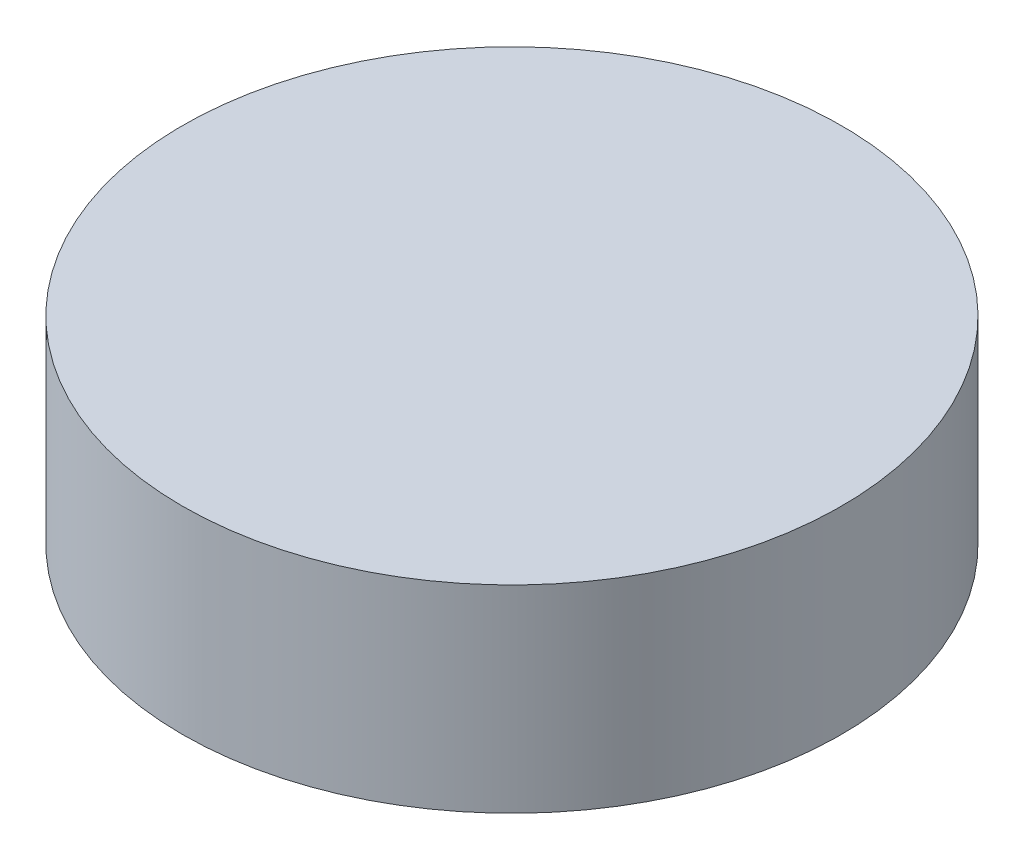
ISO-10303-21;
HEADER;
FILE_DESCRIPTION(('STEP AP214'),'2;1');
FILE_NAME('part.step','',(''),(''),'','','');
FILE_SCHEMA(('AUTOMOTIVE_DESIGN { 1 0 10303 214 1 1 1 1 }'));
ENDSEC;
DATA;
#1=APPLICATION_CONTEXT('core data for automotive mechanical design processes');
#2=APPLICATION_PROTOCOL_DEFINITION('international standard','automotive_design',2000,#1);
#3=PRODUCT_CONTEXT('',#1,'mechanical');
#4=PRODUCT('Part','Part','',(#3));
#5=PRODUCT_RELATED_PRODUCT_CATEGORY('part','',(#4));
#6=PRODUCT_DEFINITION_FORMATION('','',#4);
#7=PRODUCT_DEFINITION_CONTEXT('part definition',#1,'design');
#8=PRODUCT_DEFINITION('design','',#6,#7);
#9=PRODUCT_DEFINITION_SHAPE('','',#8);
#10=(LENGTH_UNIT() NAMED_UNIT(*) SI_UNIT(.MILLI.,.METRE.));
#11=(NAMED_UNIT(*) PLANE_ANGLE_UNIT() SI_UNIT($,.RADIAN.));
#12=(NAMED_UNIT(*) SI_UNIT($,.STERADIAN.) SOLID_ANGLE_UNIT());
#13=UNCERTAINTY_MEASURE_WITH_UNIT(LENGTH_MEASURE(1.E-05),#10,'distance_accuracy_value','');
#14=(GEOMETRIC_REPRESENTATION_CONTEXT(3) GLOBAL_UNCERTAINTY_ASSIGNED_CONTEXT((#13)) GLOBAL_UNIT_ASSIGNED_CONTEXT((#10,
#11,#12)) REPRESENTATION_CONTEXT('',''));
#15=CARTESIAN_POINT('',(0.,0.,0.));
#16=DIRECTION('',(0.,0.,1.));
#17=DIRECTION('',(1.,0.,0.));
#18=AXIS2_PLACEMENT_3D('',#15,#16,#17);
#19=CARTESIAN_POINT('',(0.,30.,0.));
#20=DIRECTION('',(0.,-1.,0.));
#21=DIRECTION('',(0.,0.,-1.));
#22=AXIS2_PLACEMENT_3D('',#19,#20,#21);
#23=CYLINDRICAL_SURFACE('',#22,50.);
#24=CARTESIAN_POINT('',(0.,30.,0.));
#25=DIRECTION('',(0.,1.,0.));
#26=DIRECTION('',(0.,0.,1.));
#27=AXIS2_PLACEMENT_3D('',#24,#25,#26);
#28=CIRCLE('',#27,50.);
#29=CARTESIAN_POINT('',(0.,30.,50.));
#30=VERTEX_POINT('',#29);
#31=EDGE_CURVE('E10',#30,#30,#28,.T.);
#32=ORIENTED_EDGE('',*,*,#31,.F.);
#33=EDGE_LOOP('',(#32));
#34=FACE_BOUND('',#33,.T.);
#35=CARTESIAN_POINT('',(0.,0.,0.));
#36=DIRECTION('',(0.,1.,0.));
#37=DIRECTION('',(0.,0.,1.));
#38=AXIS2_PLACEMENT_3D('',#35,#36,#37);
#39=CIRCLE('',#38,50.);
#40=CARTESIAN_POINT('',(0.,0.,50.));
#41=VERTEX_POINT('',#40);
#42=EDGE_CURVE('E34',#41,#41,#39,.T.);
#43=ORIENTED_EDGE('',*,*,#42,.T.);
#44=EDGE_LOOP('',(#43));
#45=FACE_BOUND('',#44,.T.);
#46=ADVANCED_FACE('F31',(#34,#45),#23,.T.);
#47=CARTESIAN_POINT('',(0.,30.,0.));
#48=DIRECTION('',(0.,1.,0.));
#49=DIRECTION('',(0.,0.,1.));
#50=AXIS2_PLACEMENT_3D('',#47,#48,#49);
#51=PLANE('',#50);
#52=ORIENTED_EDGE('',*,*,#31,.T.);
#53=EDGE_LOOP('',(#52));
#54=FACE_BOUND('',#53,.T.);
#55=ADVANCED_FACE('F46',(#54),#51,.T.);
#56=CARTESIAN_POINT('',(0.,0.,0.));
#57=DIRECTION('',(0.,1.,0.));
#58=DIRECTION('',(0.,0.,1.));
#59=AXIS2_PLACEMENT_3D('',#56,#57,#58);
#60=PLANE('',#59);
#61=ORIENTED_EDGE('',*,*,#42,.F.);
#62=EDGE_LOOP('',(#61));
#63=FACE_BOUND('',#62,.T.);
#64=ADVANCED_FACE('F44',(#63),#60,.F.);
#65=CLOSED_SHELL('',(#46,#55,#64));
#66=MANIFOLD_SOLID_BREP('B2',#65);
#67=ADVANCED_BREP_SHAPE_REPRESENTATION('',(#18,#66),#14);
#68=SHAPE_DEFINITION_REPRESENTATION(#9,#67);
ENDSEC;
END-ISO-10303-21;
